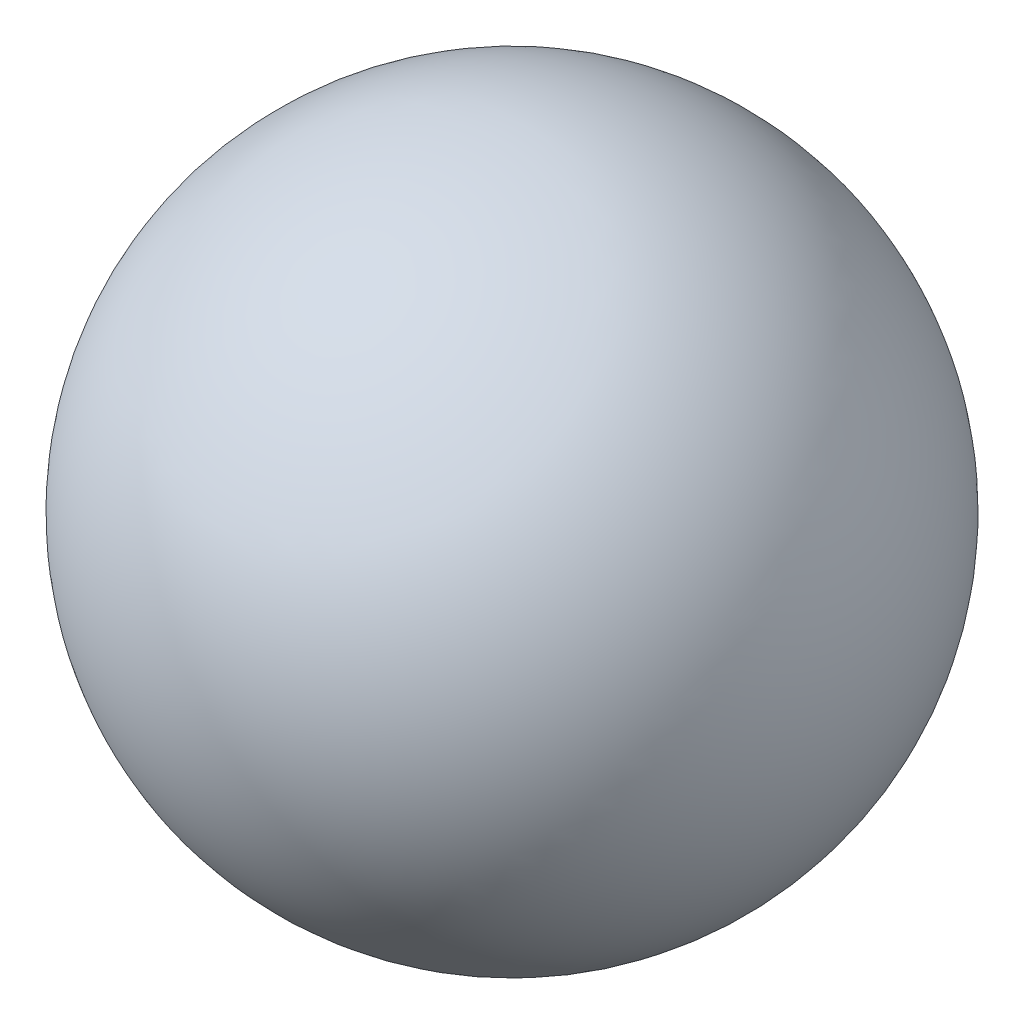
ISO-10303-21;
HEADER;
FILE_DESCRIPTION(('STEP AP214'),'2;1');
FILE_NAME('part.step','',(''),(''),'','','');
FILE_SCHEMA(('AUTOMOTIVE_DESIGN { 1 0 10303 214 1 1 1 1 }'));
ENDSEC;
DATA;
#1=APPLICATION_CONTEXT('core data for automotive mechanical design processes');
#2=APPLICATION_PROTOCOL_DEFINITION('international standard','automotive_design',2000,#1);
#3=PRODUCT_CONTEXT('',#1,'mechanical');
#4=PRODUCT('Part','Part','',(#3));
#5=PRODUCT_RELATED_PRODUCT_CATEGORY('part','',(#4));
#6=PRODUCT_DEFINITION_FORMATION('','',#4);
#7=PRODUCT_DEFINITION_CONTEXT('part definition',#1,'design');
#8=PRODUCT_DEFINITION('design','',#6,#7);
#9=PRODUCT_DEFINITION_SHAPE('','',#8);
#10=(LENGTH_UNIT() NAMED_UNIT(*) SI_UNIT(.MILLI.,.METRE.));
#11=(NAMED_UNIT(*) PLANE_ANGLE_UNIT() SI_UNIT($,.RADIAN.));
#12=(NAMED_UNIT(*) SI_UNIT($,.STERADIAN.) SOLID_ANGLE_UNIT());
#13=UNCERTAINTY_MEASURE_WITH_UNIT(LENGTH_MEASURE(1.E-05),#10,'distance_accuracy_value','');
#14=(GEOMETRIC_REPRESENTATION_CONTEXT(3) GLOBAL_UNCERTAINTY_ASSIGNED_CONTEXT((#13)) GLOBAL_UNIT_ASSIGNED_CONTEXT((#10,
#11,#12)) REPRESENTATION_CONTEXT('',''));
#15=CARTESIAN_POINT('',(0.,0.,0.));
#16=DIRECTION('',(0.,0.,1.));
#17=DIRECTION('',(1.,0.,0.));
#18=AXIS2_PLACEMENT_3D('',#15,#16,#17);
#19=CARTESIAN_POINT('',(6.35252960510324,-2.,9.8847290107664));
#20=DIRECTION('',(0.,0.,1.));
#21=DIRECTION('',(1.,0.,0.));
#22=AXIS2_PLACEMENT_3D('',#19,#20,#21);
#23=SPHERICAL_SURFACE('',#22,1.05);
#24=CARTESIAN_POINT('',(6.35252960510324,-2.,10.9347290107664));
#25=VERTEX_POINT('',#24);
#26=VERTEX_LOOP('',#25);
#27=FACE_BOUND('',#26,.T.);
#28=ADVANCED_FACE('F13',(#27),#23,.T.);
#29=CLOSED_SHELL('',(#28));
#30=MANIFOLD_SOLID_BREP('B1',#29);
#31=ADVANCED_BREP_SHAPE_REPRESENTATION('',(#18,#30),#14);
#32=SHAPE_DEFINITION_REPRESENTATION(#9,#31);
ENDSEC;
END-ISO-10303-21;
